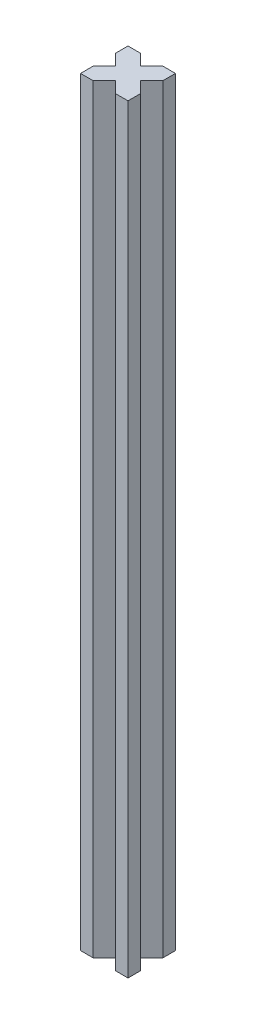
ISO-10303-21;
HEADER;
FILE_DESCRIPTION(('STEP AP214'),'2;1');
FILE_NAME('part.step','',(''),(''),'','','');
FILE_SCHEMA(('AUTOMOTIVE_DESIGN { 1 0 10303 214 1 1 1 1 }'));
ENDSEC;
DATA;
#1=APPLICATION_CONTEXT('core data for automotive mechanical design processes');
#2=APPLICATION_PROTOCOL_DEFINITION('international standard','automotive_design',2000,#1);
#3=PRODUCT_CONTEXT('',#1,'mechanical');
#4=PRODUCT('Part','Part','',(#3));
#5=PRODUCT_RELATED_PRODUCT_CATEGORY('part','',(#4));
#6=PRODUCT_DEFINITION_FORMATION('','',#4);
#7=PRODUCT_DEFINITION_CONTEXT('part definition',#1,'design');
#8=PRODUCT_DEFINITION('design','',#6,#7);
#9=PRODUCT_DEFINITION_SHAPE('','',#8);
#10=(LENGTH_UNIT() NAMED_UNIT(*) SI_UNIT(.MILLI.,.METRE.));
#11=(NAMED_UNIT(*) PLANE_ANGLE_UNIT() SI_UNIT($,.RADIAN.));
#12=(NAMED_UNIT(*) SI_UNIT($,.STERADIAN.) SOLID_ANGLE_UNIT());
#13=UNCERTAINTY_MEASURE_WITH_UNIT(LENGTH_MEASURE(1.E-05),#10,'distance_accuracy_value','');
#14=(GEOMETRIC_REPRESENTATION_CONTEXT(3) GLOBAL_UNCERTAINTY_ASSIGNED_CONTEXT((#13)) GLOBAL_UNIT_ASSIGNED_CONTEXT((#10,
#11,#12)) REPRESENTATION_CONTEXT('',''));
#15=CARTESIAN_POINT('',(0.,0.,0.));
#16=DIRECTION('',(0.,0.,1.));
#17=DIRECTION('',(1.,0.,0.));
#18=AXIS2_PLACEMENT_3D('',#15,#16,#17);
#19=CARTESIAN_POINT('',(4.00000000000001,240.,-15.));
#20=DIRECTION('',(-0.707106781186549,0.,0.707106781186546));
#21=DIRECTION('',(0.707106781186546,0.,0.707106781186549));
#22=AXIS2_PLACEMENT_3D('',#19,#20,#21);
#23=PLANE('',#22);
#24=DIRECTION('',(-0.707106781186546,0.,-0.707106781186549));
#25=VECTOR('',#24,1.);
#26=CARTESIAN_POINT('',(4.00000000000001,0.,-15.));
#27=LINE('',#26,#25);
#28=CARTESIAN_POINT('',(7.5,0.,-11.5));
#29=VERTEX_POINT('',#28);
#30=CARTESIAN_POINT('',(4.00000000000001,0.,-15.));
#31=VERTEX_POINT('',#30);
#32=EDGE_CURVE('E188',#29,#31,#27,.T.);
#33=ORIENTED_EDGE('',*,*,#32,.T.);
#34=DIRECTION('',(0.,-1.,0.));
#35=VECTOR('',#34,1.);
#36=CARTESIAN_POINT('',(4.00000000000001,240.,-15.));
#37=LINE('',#36,#35);
#38=CARTESIAN_POINT('',(4.00000000000001,240.,-15.));
#39=VERTEX_POINT('',#38);
#40=EDGE_CURVE('E11',#39,#31,#37,.T.);
#41=ORIENTED_EDGE('',*,*,#40,.F.);
#42=DIRECTION('',(-0.707106781186546,0.,-0.707106781186549));
#43=VECTOR('',#42,1.);
#44=CARTESIAN_POINT('',(4.00000000000001,240.,-15.));
#45=LINE('',#44,#43);
#46=CARTESIAN_POINT('',(7.5,240.,-11.5));
#47=VERTEX_POINT('',#46);
#48=EDGE_CURVE('E234',#47,#39,#45,.T.);
#49=ORIENTED_EDGE('',*,*,#48,.F.);
#50=DIRECTION('',(0.,-1.,0.));
#51=VECTOR('',#50,1.);
#52=CARTESIAN_POINT('',(7.5,240.,-11.5));
#53=LINE('',#52,#51);
#54=EDGE_CURVE('E184',#47,#29,#53,.T.);
#55=ORIENTED_EDGE('',*,*,#54,.T.);
#56=EDGE_LOOP('',(#33,#41,#49,#55));
#57=FACE_BOUND('',#56,.T.);
#58=ADVANCED_FACE('F39',(#57),#23,.F.);
#59=CARTESIAN_POINT('',(0.,240.,-15.));
#60=DIRECTION('',(0.,0.,1.));
#61=DIRECTION('',(1.,0.,0.));
#62=AXIS2_PLACEMENT_3D('',#59,#60,#61);
#63=PLANE('',#62);
#64=DIRECTION('',(-1.,0.,0.));
#65=VECTOR('',#64,1.);
#66=CARTESIAN_POINT('',(0.,0.,-15.));
#67=LINE('',#66,#65);
#68=CARTESIAN_POINT('',(0.,0.,-15.));
#69=VERTEX_POINT('',#68);
#70=EDGE_CURVE('E192',#31,#69,#67,.T.);
#71=ORIENTED_EDGE('',*,*,#70,.T.);
#72=DIRECTION('',(0.,-1.,0.));
#73=VECTOR('',#72,1.);
#74=CARTESIAN_POINT('',(0.,240.,-15.));
#75=LINE('',#74,#73);
#76=CARTESIAN_POINT('',(0.,240.,-15.));
#77=VERTEX_POINT('',#76);
#78=EDGE_CURVE('E48',#77,#69,#75,.T.);
#79=ORIENTED_EDGE('',*,*,#78,.F.);
#80=DIRECTION('',(-1.,0.,0.));
#81=VECTOR('',#80,1.);
#82=CARTESIAN_POINT('',(0.,240.,-15.));
#83=LINE('',#82,#81);
#84=EDGE_CURVE('E123',#39,#77,#83,.T.);
#85=ORIENTED_EDGE('',*,*,#84,.F.);
#86=ORIENTED_EDGE('',*,*,#40,.T.);
#87=EDGE_LOOP('',(#71,#79,#85,#86));
#88=FACE_BOUND('',#87,.T.);
#89=ADVANCED_FACE('F356',(#88),#63,.F.);
#90=CARTESIAN_POINT('',(0.,240.,-11.));
#91=DIRECTION('',(1.,0.,0.));
#92=DIRECTION('',(0.,0.,-1.));
#93=AXIS2_PLACEMENT_3D('',#90,#91,#92);
#94=PLANE('',#93);
#95=DIRECTION('',(0.,0.,1.));
#96=VECTOR('',#95,1.);
#97=CARTESIAN_POINT('',(0.,0.,-11.));
#98=LINE('',#97,#96);
#99=CARTESIAN_POINT('',(0.,0.,-11.));
#100=VERTEX_POINT('',#99);
#101=EDGE_CURVE('E195',#69,#100,#98,.T.);
#102=ORIENTED_EDGE('',*,*,#101,.T.);
#103=DIRECTION('',(0.,-1.,0.));
#104=VECTOR('',#103,1.);
#105=CARTESIAN_POINT('',(0.,240.,-11.));
#106=LINE('',#105,#104);
#107=CARTESIAN_POINT('',(0.,240.,-11.));
#108=VERTEX_POINT('',#107);
#109=EDGE_CURVE('E277',#108,#100,#106,.T.);
#110=ORIENTED_EDGE('',*,*,#109,.F.);
#111=DIRECTION('',(0.,0.,1.));
#112=VECTOR('',#111,1.);
#113=CARTESIAN_POINT('',(0.,240.,-11.));
#114=LINE('',#113,#112);
#115=EDGE_CURVE('E287',#77,#108,#114,.T.);
#116=ORIENTED_EDGE('',*,*,#115,.F.);
#117=ORIENTED_EDGE('',*,*,#78,.T.);
#118=EDGE_LOOP('',(#102,#110,#116,#117));
#119=FACE_BOUND('',#118,.T.);
#120=ADVANCED_FACE('F285',(#119),#94,.F.);
#121=CARTESIAN_POINT('',(3.5,240.,-7.5));
#122=DIRECTION('',(0.707106781186548,0.,-0.707106781186547));
#123=DIRECTION('',(-0.707106781186547,0.,-0.707106781186548));
#124=AXIS2_PLACEMENT_3D('',#121,#122,#123);
#125=PLANE('',#124);
#126=DIRECTION('',(0.707106781186547,0.,0.707106781186548));
#127=VECTOR('',#126,1.);
#128=CARTESIAN_POINT('',(3.5,0.,-7.5));
#129=LINE('',#128,#127);
#130=CARTESIAN_POINT('',(3.5,0.,-7.5));
#131=VERTEX_POINT('',#130);
#132=EDGE_CURVE('E198',#100,#131,#129,.T.);
#133=ORIENTED_EDGE('',*,*,#132,.T.);
#134=DIRECTION('',(0.,-1.,0.));
#135=VECTOR('',#134,1.);
#136=CARTESIAN_POINT('',(3.5,240.,-7.5));
#137=LINE('',#136,#135);
#138=CARTESIAN_POINT('',(3.5,240.,-7.5));
#139=VERTEX_POINT('',#138);
#140=EDGE_CURVE('E273',#139,#131,#137,.T.);
#141=ORIENTED_EDGE('',*,*,#140,.F.);
#142=DIRECTION('',(0.707106781186547,0.,0.707106781186548));
#143=VECTOR('',#142,1.);
#144=CARTESIAN_POINT('',(3.5,240.,-7.5));
#145=LINE('',#144,#143);
#146=EDGE_CURVE('E306',#108,#139,#145,.T.);
#147=ORIENTED_EDGE('',*,*,#146,.F.);
#148=ORIENTED_EDGE('',*,*,#109,.T.);
#149=EDGE_LOOP('',(#133,#141,#147,#148));
#150=FACE_BOUND('',#149,.T.);
#151=ADVANCED_FACE('F296',(#150),#125,.F.);
#152=CARTESIAN_POINT('',(0.,240.,-4.00000000000001));
#153=DIRECTION('',(0.707106781186546,0.,0.707106781186549));
#154=DIRECTION('',(0.707106781186549,0.,-0.707106781186546));
#155=AXIS2_PLACEMENT_3D('',#152,#153,#154);
#156=PLANE('',#155);
#157=DIRECTION('',(-0.707106781186549,0.,0.707106781186546));
#158=VECTOR('',#157,1.);
#159=CARTESIAN_POINT('',(0.,0.,-4.00000000000001));
#160=LINE('',#159,#158);
#161=CARTESIAN_POINT('',(0.,0.,-4.00000000000001));
#162=VERTEX_POINT('',#161);
#163=EDGE_CURVE('E201',#131,#162,#160,.T.);
#164=ORIENTED_EDGE('',*,*,#163,.T.);
#165=DIRECTION('',(0.,-1.,0.));
#166=VECTOR('',#165,1.);
#167=CARTESIAN_POINT('',(0.,240.,-4.00000000000001));
#168=LINE('',#167,#166);
#169=CARTESIAN_POINT('',(0.,240.,-4.00000000000001));
#170=VERTEX_POINT('',#169);
#171=EDGE_CURVE('E269',#170,#162,#168,.T.);
#172=ORIENTED_EDGE('',*,*,#171,.F.);
#173=DIRECTION('',(-0.707106781186549,0.,0.707106781186546));
#174=VECTOR('',#173,1.);
#175=CARTESIAN_POINT('',(0.,240.,-4.00000000000001));
#176=LINE('',#175,#174);
#177=EDGE_CURVE('E302',#139,#170,#176,.T.);
#178=ORIENTED_EDGE('',*,*,#177,.F.);
#179=ORIENTED_EDGE('',*,*,#140,.T.);
#180=EDGE_LOOP('',(#164,#172,#178,#179));
#181=FACE_BOUND('',#180,.T.);
#182=ADVANCED_FACE('F300',(#181),#156,.F.);
#183=CARTESIAN_POINT('',(0.,240.,0.));
#184=DIRECTION('',(1.,0.,0.));
#185=DIRECTION('',(0.,0.,-1.));
#186=AXIS2_PLACEMENT_3D('',#183,#184,#185);
#187=PLANE('',#186);
#188=DIRECTION('',(0.,0.,1.));
#189=VECTOR('',#188,1.);
#190=CARTESIAN_POINT('',(0.,0.,0.));
#191=LINE('',#190,#189);
#192=CARTESIAN_POINT('',(0.,0.,0.));
#193=VERTEX_POINT('',#192);
#194=EDGE_CURVE('E204',#162,#193,#191,.T.);
#195=ORIENTED_EDGE('',*,*,#194,.T.);
#196=DIRECTION('',(0.,-1.,0.));
#197=VECTOR('',#196,1.);
#198=CARTESIAN_POINT('',(0.,240.,0.));
#199=LINE('',#198,#197);
#200=CARTESIAN_POINT('',(0.,240.,0.));
#201=VERTEX_POINT('',#200);
#202=EDGE_CURVE('E265',#201,#193,#199,.T.);
#203=ORIENTED_EDGE('',*,*,#202,.F.);
#204=DIRECTION('',(0.,0.,1.));
#205=VECTOR('',#204,1.);
#206=CARTESIAN_POINT('',(0.,240.,0.));
#207=LINE('',#206,#205);
#208=EDGE_CURVE('E305',#170,#201,#207,.T.);
#209=ORIENTED_EDGE('',*,*,#208,.F.);
#210=ORIENTED_EDGE('',*,*,#171,.T.);
#211=EDGE_LOOP('',(#195,#203,#209,#210));
#212=FACE_BOUND('',#211,.T.);
#213=ADVANCED_FACE('F369',(#212),#187,.F.);
#214=CARTESIAN_POINT('',(0.,240.,0.));
#215=DIRECTION('',(0.,0.,-1.));
#216=DIRECTION('',(-1.,0.,0.));
#217=AXIS2_PLACEMENT_3D('',#214,#215,#216);
#218=PLANE('',#217);
#219=DIRECTION('',(1.,0.,0.));
#220=VECTOR('',#219,1.);
#221=CARTESIAN_POINT('',(0.,0.,0.));
#222=LINE('',#221,#220);
#223=CARTESIAN_POINT('',(4.00000000000004,0.,0.));
#224=VERTEX_POINT('',#223);
#225=EDGE_CURVE('E207',#193,#224,#222,.T.);
#226=ORIENTED_EDGE('',*,*,#225,.T.);
#227=DIRECTION('',(0.,-1.,0.));
#228=VECTOR('',#227,1.);
#229=CARTESIAN_POINT('',(4.00000000000004,240.,0.));
#230=LINE('',#229,#228);
#231=CARTESIAN_POINT('',(4.00000000000004,240.,0.));
#232=VERTEX_POINT('',#231);
#233=EDGE_CURVE('E261',#232,#224,#230,.T.);
#234=ORIENTED_EDGE('',*,*,#233,.F.);
#235=DIRECTION('',(1.,0.,0.));
#236=VECTOR('',#235,1.);
#237=CARTESIAN_POINT('',(0.,240.,0.));
#238=LINE('',#237,#236);
#239=EDGE_CURVE('E310',#201,#232,#238,.T.);
#240=ORIENTED_EDGE('',*,*,#239,.F.);
#241=ORIENTED_EDGE('',*,*,#202,.T.);
#242=EDGE_LOOP('',(#226,#234,#240,#241));
#243=FACE_BOUND('',#242,.T.);
#244=ADVANCED_FACE('F372',(#243),#218,.F.);
#245=CARTESIAN_POINT('',(7.5,240.,-3.5));
#246=DIRECTION('',(-0.707106781186551,0.,-0.707106781186544));
#247=DIRECTION('',(-0.707106781186544,0.,0.707106781186551));
#248=AXIS2_PLACEMENT_3D('',#245,#246,#247);
#249=PLANE('',#248);
#250=DIRECTION('',(0.707106781186544,0.,-0.707106781186551));
#251=VECTOR('',#250,1.);
#252=CARTESIAN_POINT('',(7.5,0.,-3.5));
#253=LINE('',#252,#251);
#254=CARTESIAN_POINT('',(7.5,0.,-3.5));
#255=VERTEX_POINT('',#254);
#256=EDGE_CURVE('E210',#224,#255,#253,.T.);
#257=ORIENTED_EDGE('',*,*,#256,.T.);
#258=DIRECTION('',(0.,-1.,0.));
#259=VECTOR('',#258,1.);
#260=CARTESIAN_POINT('',(7.5,240.,-3.5));
#261=LINE('',#260,#259);
#262=CARTESIAN_POINT('',(7.5,240.,-3.5));
#263=VERTEX_POINT('',#262);
#264=EDGE_CURVE('E257',#263,#255,#261,.T.);
#265=ORIENTED_EDGE('',*,*,#264,.F.);
#266=DIRECTION('',(0.707106781186544,0.,-0.707106781186551));
#267=VECTOR('',#266,1.);
#268=CARTESIAN_POINT('',(7.5,240.,-3.5));
#269=LINE('',#268,#267);
#270=EDGE_CURVE('E317',#232,#263,#269,.T.);
#271=ORIENTED_EDGE('',*,*,#270,.F.);
#272=ORIENTED_EDGE('',*,*,#233,.T.);
#273=EDGE_LOOP('',(#257,#265,#271,#272));
#274=FACE_BOUND('',#273,.T.);
#275=ADVANCED_FACE('F376',(#274),#249,.F.);
#276=CARTESIAN_POINT('',(11.,240.,0.));
#277=DIRECTION('',(0.707106781186544,0.,-0.707106781186551));
#278=DIRECTION('',(-0.707106781186551,0.,-0.707106781186544));
#279=AXIS2_PLACEMENT_3D('',#276,#277,#278);
#280=PLANE('',#279);
#281=DIRECTION('',(0.707106781186551,0.,0.707106781186544));
#282=VECTOR('',#281,1.);
#283=CARTESIAN_POINT('',(11.,0.,0.));
#284=LINE('',#283,#282);
#285=CARTESIAN_POINT('',(11.,0.,0.));
#286=VERTEX_POINT('',#285);
#287=EDGE_CURVE('E213',#255,#286,#284,.T.);
#288=ORIENTED_EDGE('',*,*,#287,.T.);
#289=DIRECTION('',(0.,-1.,0.));
#290=VECTOR('',#289,1.);
#291=CARTESIAN_POINT('',(11.,240.,0.));
#292=LINE('',#291,#290);
#293=CARTESIAN_POINT('',(11.,240.,0.));
#294=VERTEX_POINT('',#293);
#295=EDGE_CURVE('E253',#294,#286,#292,.T.);
#296=ORIENTED_EDGE('',*,*,#295,.F.);
#297=DIRECTION('',(0.707106781186551,0.,0.707106781186544));
#298=VECTOR('',#297,1.);
#299=CARTESIAN_POINT('',(11.,240.,0.));
#300=LINE('',#299,#298);
#301=EDGE_CURVE('E320',#263,#294,#300,.T.);
#302=ORIENTED_EDGE('',*,*,#301,.F.);
#303=ORIENTED_EDGE('',*,*,#264,.T.);
#304=EDGE_LOOP('',(#288,#296,#302,#303));
#305=FACE_BOUND('',#304,.T.);
#306=ADVANCED_FACE('F380',(#305),#280,.F.);
#307=CARTESIAN_POINT('',(11.,240.,0.));
#308=DIRECTION('',(0.,0.,-1.));
#309=DIRECTION('',(-1.,0.,0.));
#310=AXIS2_PLACEMENT_3D('',#307,#308,#309);
#311=PLANE('',#310);
#312=DIRECTION('',(1.,0.,0.));
#313=VECTOR('',#312,1.);
#314=CARTESIAN_POINT('',(11.,0.,0.));
#315=LINE('',#314,#313);
#316=CARTESIAN_POINT('',(15.,0.,0.));
#317=VERTEX_POINT('',#316);
#318=EDGE_CURVE('E216',#286,#317,#315,.T.);
#319=ORIENTED_EDGE('',*,*,#318,.T.);
#320=DIRECTION('',(0.,-1.,0.));
#321=VECTOR('',#320,1.);
#322=CARTESIAN_POINT('',(15.,240.,0.));
#323=LINE('',#322,#321);
#324=CARTESIAN_POINT('',(15.,240.,0.));
#325=VERTEX_POINT('',#324);
#326=EDGE_CURVE('E249',#325,#317,#323,.T.);
#327=ORIENTED_EDGE('',*,*,#326,.F.);
#328=DIRECTION('',(1.,0.,0.));
#329=VECTOR('',#328,1.);
#330=CARTESIAN_POINT('',(11.,240.,0.));
#331=LINE('',#330,#329);
#332=EDGE_CURVE('E323',#294,#325,#331,.T.);
#333=ORIENTED_EDGE('',*,*,#332,.F.);
#334=ORIENTED_EDGE('',*,*,#295,.T.);
#335=EDGE_LOOP('',(#319,#327,#333,#334));
#336=FACE_BOUND('',#335,.T.);
#337=ADVANCED_FACE('F384',(#336),#311,.F.);
#338=CARTESIAN_POINT('',(15.,240.,0.));
#339=DIRECTION('',(-1.,0.,0.));
#340=DIRECTION('',(0.,0.,1.));
#341=AXIS2_PLACEMENT_3D('',#338,#339,#340);
#342=PLANE('',#341);
#343=DIRECTION('',(0.,0.,-1.));
#344=VECTOR('',#343,1.);
#345=CARTESIAN_POINT('',(15.,0.,0.));
#346=LINE('',#345,#344);
#347=CARTESIAN_POINT('',(15.,0.,-3.99999999999996));
#348=VERTEX_POINT('',#347);
#349=EDGE_CURVE('E219',#317,#348,#346,.T.);
#350=ORIENTED_EDGE('',*,*,#349,.T.);
#351=DIRECTION('',(0.,-1.,0.));
#352=VECTOR('',#351,1.);
#353=CARTESIAN_POINT('',(15.,240.,-3.99999999999996));
#354=LINE('',#353,#352);
#355=CARTESIAN_POINT('',(15.,240.,-3.99999999999996));
#356=VERTEX_POINT('',#355);
#357=EDGE_CURVE('E245',#356,#348,#354,.T.);
#358=ORIENTED_EDGE('',*,*,#357,.F.);
#359=DIRECTION('',(0.,0.,-1.));
#360=VECTOR('',#359,1.);
#361=CARTESIAN_POINT('',(15.,240.,0.));
#362=LINE('',#361,#360);
#363=EDGE_CURVE('E326',#325,#356,#362,.T.);
#364=ORIENTED_EDGE('',*,*,#363,.F.);
#365=ORIENTED_EDGE('',*,*,#326,.T.);
#366=EDGE_LOOP('',(#350,#358,#364,#365));
#367=FACE_BOUND('',#366,.T.);
#368=ADVANCED_FACE('F388',(#367),#342,.F.);
#369=CARTESIAN_POINT('',(11.5,240.,-7.5));
#370=DIRECTION('',(-0.707106781186551,0.,0.707106781186544));
#371=DIRECTION('',(0.707106781186544,0.,0.707106781186551));
#372=AXIS2_PLACEMENT_3D('',#369,#370,#371);
#373=PLANE('',#372);
#374=DIRECTION('',(-0.707106781186544,0.,-0.707106781186551));
#375=VECTOR('',#374,1.);
#376=CARTESIAN_POINT('',(11.5,0.,-7.5));
#377=LINE('',#376,#375);
#378=CARTESIAN_POINT('',(11.5,0.,-7.5));
#379=VERTEX_POINT('',#378);
#380=EDGE_CURVE('E222',#348,#379,#377,.T.);
#381=ORIENTED_EDGE('',*,*,#380,.T.);
#382=DIRECTION('',(0.,-1.,0.));
#383=VECTOR('',#382,1.);
#384=CARTESIAN_POINT('',(11.5,240.,-7.5));
#385=LINE('',#384,#383);
#386=CARTESIAN_POINT('',(11.5,240.,-7.5));
#387=VERTEX_POINT('',#386);
#388=EDGE_CURVE('E241',#387,#379,#385,.T.);
#389=ORIENTED_EDGE('',*,*,#388,.F.);
#390=DIRECTION('',(-0.707106781186544,0.,-0.707106781186551));
#391=VECTOR('',#390,1.);
#392=CARTESIAN_POINT('',(11.5,240.,-7.5));
#393=LINE('',#392,#391);
#394=EDGE_CURVE('E329',#356,#387,#393,.T.);
#395=ORIENTED_EDGE('',*,*,#394,.F.);
#396=ORIENTED_EDGE('',*,*,#357,.T.);
#397=EDGE_LOOP('',(#381,#389,#395,#396));
#398=FACE_BOUND('',#397,.T.);
#399=ADVANCED_FACE('F337',(#398),#373,.F.);
#400=CARTESIAN_POINT('',(15.,240.,-11.));
#401=DIRECTION('',(-0.707106781186544,0.,-0.707106781186551));
#402=DIRECTION('',(-0.707106781186551,0.,0.707106781186544));
#403=AXIS2_PLACEMENT_3D('',#400,#401,#402);
#404=PLANE('',#403);
#405=DIRECTION('',(0.707106781186551,0.,-0.707106781186544));
#406=VECTOR('',#405,1.);
#407=CARTESIAN_POINT('',(15.,0.,-11.));
#408=LINE('',#407,#406);
#409=CARTESIAN_POINT('',(15.,0.,-11.));
#410=VERTEX_POINT('',#409);
#411=EDGE_CURVE('E225',#379,#410,#408,.T.);
#412=ORIENTED_EDGE('',*,*,#411,.T.);
#413=DIRECTION('',(0.,-1.,0.));
#414=VECTOR('',#413,1.);
#415=CARTESIAN_POINT('',(15.,240.,-11.));
#416=LINE('',#415,#414);
#417=CARTESIAN_POINT('',(15.,240.,-11.));
#418=VERTEX_POINT('',#417);
#419=EDGE_CURVE('E177',#418,#410,#416,.T.);
#420=ORIENTED_EDGE('',*,*,#419,.F.);
#421=DIRECTION('',(0.707106781186551,0.,-0.707106781186544));
#422=VECTOR('',#421,1.);
#423=CARTESIAN_POINT('',(15.,240.,-11.));
#424=LINE('',#423,#422);
#425=EDGE_CURVE('E166',#387,#418,#424,.T.);
#426=ORIENTED_EDGE('',*,*,#425,.F.);
#427=ORIENTED_EDGE('',*,*,#388,.T.);
#428=EDGE_LOOP('',(#412,#420,#426,#427));
#429=FACE_BOUND('',#428,.T.);
#430=ADVANCED_FACE('F341',(#429),#404,.F.);
#431=CARTESIAN_POINT('',(15.,240.,-11.));
#432=DIRECTION('',(-1.,0.,0.));
#433=DIRECTION('',(0.,0.,1.));
#434=AXIS2_PLACEMENT_3D('',#431,#432,#433);
#435=PLANE('',#434);
#436=DIRECTION('',(0.,0.,-1.));
#437=VECTOR('',#436,1.);
#438=CARTESIAN_POINT('',(15.,0.,-11.));
#439=LINE('',#438,#437);
#440=CARTESIAN_POINT('',(15.,0.,-15.));
#441=VERTEX_POINT('',#440);
#442=EDGE_CURVE('E175',#410,#441,#439,.T.);
#443=ORIENTED_EDGE('',*,*,#442,.T.);
#444=DIRECTION('',(0.,-1.,0.));
#445=VECTOR('',#444,1.);
#446=CARTESIAN_POINT('',(15.,240.,-15.));
#447=LINE('',#446,#445);
#448=CARTESIAN_POINT('',(15.,240.,-15.));
#449=VERTEX_POINT('',#448);
#450=EDGE_CURVE('E172',#449,#441,#447,.T.);
#451=ORIENTED_EDGE('',*,*,#450,.F.);
#452=DIRECTION('',(0.,0.,-1.));
#453=VECTOR('',#452,1.);
#454=CARTESIAN_POINT('',(15.,240.,-11.));
#455=LINE('',#454,#453);
#456=EDGE_CURVE('E160',#418,#449,#455,.T.);
#457=ORIENTED_EDGE('',*,*,#456,.F.);
#458=ORIENTED_EDGE('',*,*,#419,.T.);
#459=EDGE_LOOP('',(#443,#451,#457,#458));
#460=FACE_BOUND('',#459,.T.);
#461=ADVANCED_FACE('F173',(#460),#435,.F.);
#462=CARTESIAN_POINT('',(11.,240.,-15.));
#463=DIRECTION('',(0.,0.,1.));
#464=DIRECTION('',(1.,0.,0.));
#465=AXIS2_PLACEMENT_3D('',#462,#463,#464);
#466=PLANE('',#465);
#467=DIRECTION('',(-1.,0.,0.));
#468=VECTOR('',#467,1.);
#469=CARTESIAN_POINT('',(11.,0.,-15.));
#470=LINE('',#469,#468);
#471=CARTESIAN_POINT('',(11.,0.,-15.));
#472=VERTEX_POINT('',#471);
#473=EDGE_CURVE('E109',#441,#472,#470,.T.);
#474=ORIENTED_EDGE('',*,*,#473,.T.);
#475=DIRECTION('',(0.,-1.,0.));
#476=VECTOR('',#475,1.);
#477=CARTESIAN_POINT('',(11.,240.,-15.));
#478=LINE('',#477,#476);
#479=CARTESIAN_POINT('',(11.,240.,-15.));
#480=VERTEX_POINT('',#479);
#481=EDGE_CURVE('E178',#480,#472,#478,.T.);
#482=ORIENTED_EDGE('',*,*,#481,.F.);
#483=DIRECTION('',(-1.,0.,0.));
#484=VECTOR('',#483,1.);
#485=CARTESIAN_POINT('',(11.,240.,-15.));
#486=LINE('',#485,#484);
#487=EDGE_CURVE('E164',#449,#480,#486,.T.);
#488=ORIENTED_EDGE('',*,*,#487,.F.);
#489=ORIENTED_EDGE('',*,*,#450,.T.);
#490=EDGE_LOOP('',(#474,#482,#488,#489));
#491=FACE_BOUND('',#490,.T.);
#492=ADVANCED_FACE('F180',(#491),#466,.F.);
#493=CARTESIAN_POINT('',(7.5,240.,-11.5));
#494=DIRECTION('',(0.707106781186547,0.,0.707106781186548));
#495=DIRECTION('',(0.707106781186548,0.,-0.707106781186547));
#496=AXIS2_PLACEMENT_3D('',#493,#494,#495);
#497=PLANE('',#496);
#498=DIRECTION('',(-0.707106781186548,0.,0.707106781186547));
#499=VECTOR('',#498,1.);
#500=CARTESIAN_POINT('',(7.5,0.,-11.5));
#501=LINE('',#500,#499);
#502=EDGE_CURVE('E115',#472,#29,#501,.T.);
#503=ORIENTED_EDGE('',*,*,#502,.T.);
#504=ORIENTED_EDGE('',*,*,#54,.F.);
#505=DIRECTION('',(-0.707106781186548,0.,0.707106781186547));
#506=VECTOR('',#505,1.);
#507=CARTESIAN_POINT('',(7.5,240.,-11.5));
#508=LINE('',#507,#506);
#509=EDGE_CURVE('E56',#480,#47,#508,.T.);
#510=ORIENTED_EDGE('',*,*,#509,.F.);
#511=ORIENTED_EDGE('',*,*,#481,.T.);
#512=EDGE_LOOP('',(#503,#504,#510,#511));
#513=FACE_BOUND('',#512,.T.);
#514=ADVANCED_FACE('F345',(#513),#497,.F.);
#515=CARTESIAN_POINT('',(0.,240.,0.));
#516=DIRECTION('',(0.,1.,0.));
#517=DIRECTION('',(0.,0.,1.));
#518=AXIS2_PLACEMENT_3D('',#515,#516,#517);
#519=PLANE('',#518);
#520=ORIENTED_EDGE('',*,*,#48,.T.);
#521=ORIENTED_EDGE('',*,*,#84,.T.);
#522=ORIENTED_EDGE('',*,*,#115,.T.);
#523=ORIENTED_EDGE('',*,*,#146,.T.);
#524=ORIENTED_EDGE('',*,*,#177,.T.);
#525=ORIENTED_EDGE('',*,*,#208,.T.);
#526=ORIENTED_EDGE('',*,*,#239,.T.);
#527=ORIENTED_EDGE('',*,*,#270,.T.);
#528=ORIENTED_EDGE('',*,*,#301,.T.);
#529=ORIENTED_EDGE('',*,*,#332,.T.);
#530=ORIENTED_EDGE('',*,*,#363,.T.);
#531=ORIENTED_EDGE('',*,*,#394,.T.);
#532=ORIENTED_EDGE('',*,*,#425,.T.);
#533=ORIENTED_EDGE('',*,*,#456,.T.);
#534=ORIENTED_EDGE('',*,*,#487,.T.);
#535=ORIENTED_EDGE('',*,*,#509,.T.);
#536=EDGE_LOOP('',(#520,#521,#522,#523,#524,#525,#526,#527,#528,#529,#530,#531,#532,#533,#534,#535));
#537=FACE_BOUND('',#536,.T.);
#538=ADVANCED_FACE('F162',(#537),#519,.T.);
#539=CARTESIAN_POINT('',(0.,0.,0.));
#540=DIRECTION('',(0.,1.,0.));
#541=DIRECTION('',(0.,0.,1.));
#542=AXIS2_PLACEMENT_3D('',#539,#540,#541);
#543=PLANE('',#542);
#544=ORIENTED_EDGE('',*,*,#32,.F.);
#545=ORIENTED_EDGE('',*,*,#502,.F.);
#546=ORIENTED_EDGE('',*,*,#473,.F.);
#547=ORIENTED_EDGE('',*,*,#442,.F.);
#548=ORIENTED_EDGE('',*,*,#411,.F.);
#549=ORIENTED_EDGE('',*,*,#380,.F.);
#550=ORIENTED_EDGE('',*,*,#349,.F.);
#551=ORIENTED_EDGE('',*,*,#318,.F.);
#552=ORIENTED_EDGE('',*,*,#287,.F.);
#553=ORIENTED_EDGE('',*,*,#256,.F.);
#554=ORIENTED_EDGE('',*,*,#225,.F.);
#555=ORIENTED_EDGE('',*,*,#194,.F.);
#556=ORIENTED_EDGE('',*,*,#163,.F.);
#557=ORIENTED_EDGE('',*,*,#132,.F.);
#558=ORIENTED_EDGE('',*,*,#101,.F.);
#559=ORIENTED_EDGE('',*,*,#70,.F.);
#560=EDGE_LOOP('',(#544,#545,#546,#547,#548,#549,#550,#551,#552,#553,#554,#555,#556,#557,#558,#559));
#561=FACE_BOUND('',#560,.T.);
#562=ADVANCED_FACE('F291',(#561),#543,.F.);
#563=CLOSED_SHELL('',(#58,#89,#120,#151,#182,#213,#244,#275,#306,#337,#368,#399,#430,#461,#492,
#514,#538,#562));
#564=MANIFOLD_SOLID_BREP('B2',#563);
#565=ADVANCED_BREP_SHAPE_REPRESENTATION('',(#18,#564),#14);
#566=SHAPE_DEFINITION_REPRESENTATION(#9,#565);
ENDSEC;
END-ISO-10303-21;
